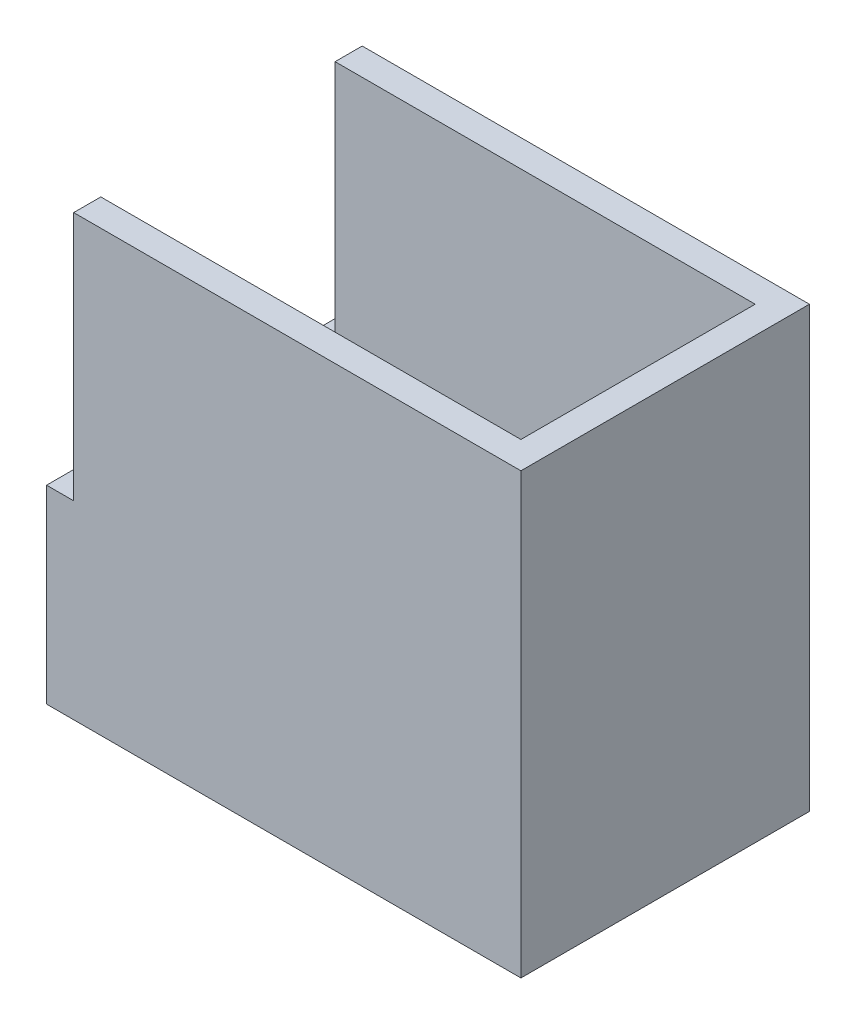
ISO-10303-21;
HEADER;
FILE_DESCRIPTION(('STEP AP214'),'2;1');
FILE_NAME('part.step','',(''),(''),'','','');
FILE_SCHEMA(('AUTOMOTIVE_DESIGN { 1 0 10303 214 1 1 1 1 }'));
ENDSEC;
DATA;
#1=APPLICATION_CONTEXT('core data for automotive mechanical design processes');
#2=APPLICATION_PROTOCOL_DEFINITION('international standard','automotive_design',2000,#1);
#3=PRODUCT_CONTEXT('',#1,'mechanical');
#4=PRODUCT('Part','Part','',(#3));
#5=PRODUCT_RELATED_PRODUCT_CATEGORY('part','',(#4));
#6=PRODUCT_DEFINITION_FORMATION('','',#4);
#7=PRODUCT_DEFINITION_CONTEXT('part definition',#1,'design');
#8=PRODUCT_DEFINITION('design','',#6,#7);
#9=PRODUCT_DEFINITION_SHAPE('','',#8);
#10=(LENGTH_UNIT() NAMED_UNIT(*) SI_UNIT(.MILLI.,.METRE.));
#11=(NAMED_UNIT(*) PLANE_ANGLE_UNIT() SI_UNIT($,.RADIAN.));
#12=(NAMED_UNIT(*) SI_UNIT($,.STERADIAN.) SOLID_ANGLE_UNIT());
#13=UNCERTAINTY_MEASURE_WITH_UNIT(LENGTH_MEASURE(1.E-05),#10,'distance_accuracy_value','');
#14=(GEOMETRIC_REPRESENTATION_CONTEXT(3) GLOBAL_UNCERTAINTY_ASSIGNED_CONTEXT((#13)) GLOBAL_UNIT_ASSIGNED_CONTEXT((#10,
#11,#12)) REPRESENTATION_CONTEXT('',''));
#15=CARTESIAN_POINT('',(0.,0.,0.));
#16=DIRECTION('',(0.,0.,1.));
#17=DIRECTION('',(1.,0.,0.));
#18=AXIS2_PLACEMENT_3D('',#15,#16,#17);
#19=CARTESIAN_POINT('',(-13.12,22.8,-7.98));
#20=DIRECTION('',(0.,0.,-1.));
#21=DIRECTION('',(-1.,0.,0.));
#22=AXIS2_PLACEMENT_3D('',#19,#20,#21);
#23=PLANE('',#22);
#24=DIRECTION('',(0.,-1.,0.));
#25=VECTOR('',#24,1.);
#26=CARTESIAN_POINT('',(-11.62,0.,-7.98));
#27=LINE('',#26,#25);
#28=CARTESIAN_POINT('',(-11.62,22.8,-7.98));
#29=VERTEX_POINT('',#28);
#30=CARTESIAN_POINT('',(-11.62,8.99,-7.98));
#31=VERTEX_POINT('',#30);
#32=EDGE_CURVE('E228',#29,#31,#27,.T.);
#33=ORIENTED_EDGE('',*,*,#32,.F.);
#34=DIRECTION('',(1.,0.,0.));
#35=VECTOR('',#34,1.);
#36=CARTESIAN_POINT('',(-13.12,22.8,-7.98));
#37=LINE('',#36,#35);
#38=CARTESIAN_POINT('',(13.12,22.8,-7.98));
#39=VERTEX_POINT('',#38);
#40=EDGE_CURVE('E332',#29,#39,#37,.T.);
#41=ORIENTED_EDGE('',*,*,#40,.T.);
#42=DIRECTION('',(0.,-1.,0.));
#43=VECTOR('',#42,1.);
#44=CARTESIAN_POINT('',(13.12,22.8,-7.98));
#45=LINE('',#44,#43);
#46=CARTESIAN_POINT('',(13.12,-1.5,-7.98));
#47=VERTEX_POINT('',#46);
#48=EDGE_CURVE('E68',#39,#47,#45,.T.);
#49=ORIENTED_EDGE('',*,*,#48,.T.);
#50=DIRECTION('',(1.,0.,0.));
#51=VECTOR('',#50,1.);
#52=CARTESIAN_POINT('',(0.,-1.5,-7.98));
#53=LINE('',#52,#51);
#54=CARTESIAN_POINT('',(-13.12,-1.5,-7.98));
#55=VERTEX_POINT('',#54);
#56=EDGE_CURVE('E264',#55,#47,#53,.T.);
#57=ORIENTED_EDGE('',*,*,#56,.F.);
#58=DIRECTION('',(0.,-1.,0.));
#59=VECTOR('',#58,1.);
#60=CARTESIAN_POINT('',(-13.12,22.8,-7.98));
#61=LINE('',#60,#59);
#62=CARTESIAN_POINT('',(-13.12,8.99,-7.98));
#63=VERTEX_POINT('',#62);
#64=EDGE_CURVE('E12',#63,#55,#61,.T.);
#65=ORIENTED_EDGE('',*,*,#64,.F.);
#66=DIRECTION('',(-1.,0.,0.));
#67=VECTOR('',#66,1.);
#68=CARTESIAN_POINT('',(10.3236824621575,8.99,-7.98));
#69=LINE('',#68,#67);
#70=EDGE_CURVE('E232',#31,#63,#69,.T.);
#71=ORIENTED_EDGE('',*,*,#70,.F.);
#72=EDGE_LOOP('',(#33,#41,#49,#57,#65,#71));
#73=FACE_BOUND('',#72,.T.);
#74=ADVANCED_FACE('F65',(#73),#23,.T.);
#75=CARTESIAN_POINT('',(-13.12,22.8,-7.98));
#76=DIRECTION('',(1.,0.,0.));
#77=DIRECTION('',(0.,0.,-1.));
#78=AXIS2_PLACEMENT_3D('',#75,#76,#77);
#79=PLANE('',#78);
#80=DIRECTION('',(0.,-1.,0.));
#81=VECTOR('',#80,1.);
#82=CARTESIAN_POINT('',(-13.12,22.8,7.98));
#83=LINE('',#82,#81);
#84=CARTESIAN_POINT('',(-13.12,8.99,7.98));
#85=VERTEX_POINT('',#84);
#86=CARTESIAN_POINT('',(-13.12,-1.5,7.98));
#87=VERTEX_POINT('',#86);
#88=EDGE_CURVE('E74',#85,#87,#83,.T.);
#89=ORIENTED_EDGE('',*,*,#88,.F.);
#90=DIRECTION('',(0.,0.,1.));
#91=VECTOR('',#90,1.);
#92=CARTESIAN_POINT('',(-13.12,8.99,0.));
#93=LINE('',#92,#91);
#94=CARTESIAN_POINT('',(-13.12,8.99,1.60078105935821));
#95=VERTEX_POINT('',#94);
#96=EDGE_CURVE('E216',#95,#85,#93,.T.);
#97=ORIENTED_EDGE('',*,*,#96,.F.);
#98=CARTESIAN_POINT('',(-13.12,9.39,0.));
#99=DIRECTION('',(-1.,0.,0.));
#100=DIRECTION('',(0.,0.,1.));
#101=AXIS2_PLACEMENT_3D('',#98,#99,#100);
#102=CIRCLE('',#101,1.65);
#103=CARTESIAN_POINT('',(-13.12,8.99,-1.60078105935821));
#104=VERTEX_POINT('',#103);
#105=EDGE_CURVE('E207',#104,#95,#102,.T.);
#106=ORIENTED_EDGE('',*,*,#105,.F.);
#107=EDGE_CURVE('E220',#63,#104,#93,.T.);
#108=ORIENTED_EDGE('',*,*,#107,.F.);
#109=ORIENTED_EDGE('',*,*,#64,.T.);
#110=DIRECTION('',(0.,0.,1.));
#111=VECTOR('',#110,1.);
#112=CARTESIAN_POINT('',(-13.12,-1.5,0.));
#113=LINE('',#112,#111);
#114=EDGE_CURVE('E268',#55,#87,#113,.T.);
#115=ORIENTED_EDGE('',*,*,#114,.T.);
#116=EDGE_LOOP('',(#89,#97,#106,#108,#109,#115));
#117=FACE_BOUND('',#116,.T.);
#118=ADVANCED_FACE('F370',(#117),#79,.F.);
#119=CARTESIAN_POINT('',(-13.12,22.8,7.98));
#120=DIRECTION('',(0.,0.,-1.));
#121=DIRECTION('',(-1.,0.,0.));
#122=AXIS2_PLACEMENT_3D('',#119,#120,#121);
#123=PLANE('',#122);
#124=DIRECTION('',(1.,0.,0.));
#125=VECTOR('',#124,1.);
#126=CARTESIAN_POINT('',(-13.12,22.8,7.98));
#127=LINE('',#126,#125);
#128=CARTESIAN_POINT('',(-11.62,22.8,7.98));
#129=VERTEX_POINT('',#128);
#130=CARTESIAN_POINT('',(13.12,22.8,7.98));
#131=VERTEX_POINT('',#130);
#132=EDGE_CURVE('E90',#129,#131,#127,.T.);
#133=ORIENTED_EDGE('',*,*,#132,.F.);
#134=DIRECTION('',(0.,1.,0.));
#135=VECTOR('',#134,1.);
#136=CARTESIAN_POINT('',(-11.62,0.,7.98));
#137=LINE('',#136,#135);
#138=CARTESIAN_POINT('',(-11.62,8.99,7.98));
#139=VERTEX_POINT('',#138);
#140=EDGE_CURVE('E237',#139,#129,#137,.T.);
#141=ORIENTED_EDGE('',*,*,#140,.F.);
#142=DIRECTION('',(-1.,0.,0.));
#143=VECTOR('',#142,1.);
#144=CARTESIAN_POINT('',(10.3236824621575,8.99,7.98));
#145=LINE('',#144,#143);
#146=EDGE_CURVE('E200',#139,#85,#145,.T.);
#147=ORIENTED_EDGE('',*,*,#146,.T.);
#148=ORIENTED_EDGE('',*,*,#88,.T.);
#149=DIRECTION('',(1.,0.,0.));
#150=VECTOR('',#149,1.);
#151=CARTESIAN_POINT('',(0.,-1.5,7.98));
#152=LINE('',#151,#150);
#153=CARTESIAN_POINT('',(13.12,-1.5,7.98));
#154=VERTEX_POINT('',#153);
#155=EDGE_CURVE('E272',#87,#154,#152,.T.);
#156=ORIENTED_EDGE('',*,*,#155,.T.);
#157=DIRECTION('',(0.,-1.,0.));
#158=VECTOR('',#157,1.);
#159=CARTESIAN_POINT('',(13.12,22.8,7.98));
#160=LINE('',#159,#158);
#161=EDGE_CURVE('E352',#131,#154,#160,.T.);
#162=ORIENTED_EDGE('',*,*,#161,.F.);
#163=EDGE_LOOP('',(#133,#141,#147,#148,#156,#162));
#164=FACE_BOUND('',#163,.T.);
#165=ADVANCED_FACE('F387',(#164),#123,.F.);
#166=CARTESIAN_POINT('',(13.12,22.8,-7.98));
#167=DIRECTION('',(1.,0.,0.));
#168=DIRECTION('',(0.,0.,-1.));
#169=AXIS2_PLACEMENT_3D('',#166,#167,#168);
#170=PLANE('',#169);
#171=ORIENTED_EDGE('',*,*,#161,.T.);
#172=DIRECTION('',(0.,0.,1.));
#173=VECTOR('',#172,1.);
#174=CARTESIAN_POINT('',(13.12,-1.5,0.));
#175=LINE('',#174,#173);
#176=EDGE_CURVE('E276',#47,#154,#175,.T.);
#177=ORIENTED_EDGE('',*,*,#176,.F.);
#178=ORIENTED_EDGE('',*,*,#48,.F.);
#179=DIRECTION('',(0.,0.,1.));
#180=VECTOR('',#179,1.);
#181=CARTESIAN_POINT('',(13.12,22.8,-7.98));
#182=LINE('',#181,#180);
#183=EDGE_CURVE('E345',#39,#131,#182,.T.);
#184=ORIENTED_EDGE('',*,*,#183,.T.);
#185=EDGE_LOOP('',(#171,#177,#178,#184));
#186=FACE_BOUND('',#185,.T.);
#187=ADVANCED_FACE('F364',(#186),#170,.T.);
#188=CARTESIAN_POINT('',(0.,22.8,0.));
#189=DIRECTION('',(0.,-1.,0.));
#190=DIRECTION('',(0.,0.,-1.));
#191=AXIS2_PLACEMENT_3D('',#188,#189,#190);
#192=PLANE('',#191);
#193=ORIENTED_EDGE('',*,*,#40,.F.);
#194=DIRECTION('',(0.,0.,-1.));
#195=VECTOR('',#194,1.);
#196=CARTESIAN_POINT('',(-11.62,22.8,0.));
#197=LINE('',#196,#195);
#198=CARTESIAN_POINT('',(-11.62,22.8,-6.48));
#199=VERTEX_POINT('',#198);
#200=EDGE_CURVE('E236',#199,#29,#197,.T.);
#201=ORIENTED_EDGE('',*,*,#200,.F.);
#202=DIRECTION('',(1.,0.,0.));
#203=VECTOR('',#202,1.);
#204=CARTESIAN_POINT('',(-11.62,22.8,-6.48));
#205=LINE('',#204,#203);
#206=CARTESIAN_POINT('',(11.62,22.8,-6.48));
#207=VERTEX_POINT('',#206);
#208=EDGE_CURVE('E301',#199,#207,#205,.T.);
#209=ORIENTED_EDGE('',*,*,#208,.T.);
#210=DIRECTION('',(0.,0.,1.));
#211=VECTOR('',#210,1.);
#212=CARTESIAN_POINT('',(11.62,22.8,-6.48));
#213=LINE('',#212,#211);
#214=CARTESIAN_POINT('',(11.62,22.8,6.48));
#215=VERTEX_POINT('',#214);
#216=EDGE_CURVE('E305',#207,#215,#213,.T.);
#217=ORIENTED_EDGE('',*,*,#216,.T.);
#218=DIRECTION('',(1.,0.,0.));
#219=VECTOR('',#218,1.);
#220=CARTESIAN_POINT('',(-11.62,22.8,6.48));
#221=LINE('',#220,#219);
#222=CARTESIAN_POINT('',(-11.62,22.8,6.48));
#223=VERTEX_POINT('',#222);
#224=EDGE_CURVE('E310',#223,#215,#221,.T.);
#225=ORIENTED_EDGE('',*,*,#224,.F.);
#226=EDGE_CURVE('E233',#129,#223,#197,.T.);
#227=ORIENTED_EDGE('',*,*,#226,.F.);
#228=ORIENTED_EDGE('',*,*,#132,.T.);
#229=ORIENTED_EDGE('',*,*,#183,.F.);
#230=EDGE_LOOP('',(#193,#201,#209,#217,#225,#227,#228,#229));
#231=FACE_BOUND('',#230,.T.);
#232=ADVANCED_FACE('F388',(#231),#192,.F.);
#233=CARTESIAN_POINT('',(-11.62,22.8,-6.48));
#234=DIRECTION('',(0.,0.,-1.));
#235=DIRECTION('',(-1.,0.,0.));
#236=AXIS2_PLACEMENT_3D('',#233,#234,#235);
#237=PLANE('',#236);
#238=DIRECTION('',(1.,0.,0.));
#239=VECTOR('',#238,1.);
#240=CARTESIAN_POINT('',(-11.62,0.,-6.48));
#241=LINE('',#240,#239);
#242=CARTESIAN_POINT('',(-11.62,0.,-6.48));
#243=VERTEX_POINT('',#242);
#244=CARTESIAN_POINT('',(-9.7,0.,-6.48));
#245=VERTEX_POINT('',#244);
#246=EDGE_CURVE('E314',#243,#245,#241,.T.);
#247=ORIENTED_EDGE('',*,*,#246,.T.);
#248=DIRECTION('',(0.,1.,0.));
#249=VECTOR('',#248,1.);
#250=CARTESIAN_POINT('',(-9.7,-1.5,-6.48));
#251=LINE('',#250,#249);
#252=CARTESIAN_POINT('',(-9.7,-1.5,-6.48));
#253=VERTEX_POINT('',#252);
#254=EDGE_CURVE('E280',#253,#245,#251,.T.);
#255=ORIENTED_EDGE('',*,*,#254,.F.);
#256=DIRECTION('',(1.,0.,0.));
#257=VECTOR('',#256,1.);
#258=CARTESIAN_POINT('',(0.,-1.5,-6.48));
#259=LINE('',#258,#257);
#260=CARTESIAN_POINT('',(-6.38,-1.5,-6.48));
#261=VERTEX_POINT('',#260);
#262=EDGE_CURVE('E252',#253,#261,#259,.T.);
#263=ORIENTED_EDGE('',*,*,#262,.T.);
#264=DIRECTION('',(0.,1.,0.));
#265=VECTOR('',#264,1.);
#266=CARTESIAN_POINT('',(-6.38,-1.5,-6.48));
#267=LINE('',#266,#265);
#268=CARTESIAN_POINT('',(-6.38,0.,-6.48));
#269=VERTEX_POINT('',#268);
#270=EDGE_CURVE('E295',#261,#269,#267,.T.);
#271=ORIENTED_EDGE('',*,*,#270,.T.);
#272=CARTESIAN_POINT('',(11.62,0.,-6.48));
#273=VERTEX_POINT('',#272);
#274=EDGE_CURVE('E291',#269,#273,#241,.T.);
#275=ORIENTED_EDGE('',*,*,#274,.T.);
#276=DIRECTION('',(0.,-1.,0.));
#277=VECTOR('',#276,1.);
#278=CARTESIAN_POINT('',(11.62,22.8,-6.48));
#279=LINE('',#278,#277);
#280=EDGE_CURVE('E313',#207,#273,#279,.T.);
#281=ORIENTED_EDGE('',*,*,#280,.F.);
#282=ORIENTED_EDGE('',*,*,#208,.F.);
#283=DIRECTION('',(0.,-1.,0.));
#284=VECTOR('',#283,1.);
#285=CARTESIAN_POINT('',(-11.62,22.8,-6.48));
#286=LINE('',#285,#284);
#287=CARTESIAN_POINT('',(-11.62,8.99,-6.48));
#288=VERTEX_POINT('',#287);
#289=EDGE_CURVE('E328',#199,#288,#286,.T.);
#290=ORIENTED_EDGE('',*,*,#289,.T.);
#291=EDGE_CURVE('E333',#288,#243,#286,.T.);
#292=ORIENTED_EDGE('',*,*,#291,.T.);
#293=EDGE_LOOP('',(#247,#255,#263,#271,#275,#281,#282,#290,#292));
#294=FACE_BOUND('',#293,.T.);
#295=ADVANCED_FACE('F390',(#294),#237,.F.);
#296=CARTESIAN_POINT('',(-11.62,22.8,-6.48));
#297=DIRECTION('',(1.,0.,0.));
#298=DIRECTION('',(0.,0.,-1.));
#299=AXIS2_PLACEMENT_3D('',#296,#297,#298);
#300=PLANE('',#299);
#301=DIRECTION('',(0.,0.,1.));
#302=VECTOR('',#301,1.);
#303=CARTESIAN_POINT('',(-11.62,8.99,0.));
#304=LINE('',#303,#302);
#305=CARTESIAN_POINT('',(-11.62,8.99,1.60078105935821));
#306=VERTEX_POINT('',#305);
#307=CARTESIAN_POINT('',(-11.62,8.99,6.48));
#308=VERTEX_POINT('',#307);
#309=EDGE_CURVE('E189',#306,#308,#304,.T.);
#310=ORIENTED_EDGE('',*,*,#309,.T.);
#311=DIRECTION('',(0.,-1.,0.));
#312=VECTOR('',#311,1.);
#313=CARTESIAN_POINT('',(-11.62,22.8,6.48));
#314=LINE('',#313,#312);
#315=CARTESIAN_POINT('',(-11.62,0.,6.48));
#316=VERTEX_POINT('',#315);
#317=EDGE_CURVE('E337',#308,#316,#314,.T.);
#318=ORIENTED_EDGE('',*,*,#317,.T.);
#319=DIRECTION('',(0.,0.,1.));
#320=VECTOR('',#319,1.);
#321=CARTESIAN_POINT('',(-11.62,0.,-6.48));
#322=LINE('',#321,#320);
#323=EDGE_CURVE('E306',#243,#316,#322,.T.);
#324=ORIENTED_EDGE('',*,*,#323,.F.);
#325=ORIENTED_EDGE('',*,*,#291,.F.);
#326=DIRECTION('',(0.,0.,1.));
#327=VECTOR('',#326,1.);
#328=CARTESIAN_POINT('',(-11.62,8.99,0.));
#329=LINE('',#328,#327);
#330=CARTESIAN_POINT('',(-11.62,8.99,-1.60078105935821));
#331=VERTEX_POINT('',#330);
#332=EDGE_CURVE('E214',#288,#331,#329,.T.);
#333=ORIENTED_EDGE('',*,*,#332,.T.);
#334=CARTESIAN_POINT('',(-11.62,9.39,0.));
#335=DIRECTION('',(1.,0.,0.));
#336=DIRECTION('',(0.,0.,-1.));
#337=AXIS2_PLACEMENT_3D('',#334,#335,#336);
#338=CIRCLE('',#337,1.65);
#339=EDGE_CURVE('E204',#331,#306,#338,.F.);
#340=ORIENTED_EDGE('',*,*,#339,.T.);
#341=EDGE_LOOP('',(#310,#318,#324,#325,#333,#340));
#342=FACE_BOUND('',#341,.T.);
#343=ADVANCED_FACE('F212',(#342),#300,.T.);
#344=CARTESIAN_POINT('',(-11.62,22.8,6.48));
#345=DIRECTION('',(0.,0.,-1.));
#346=DIRECTION('',(-1.,0.,0.));
#347=AXIS2_PLACEMENT_3D('',#344,#345,#346);
#348=PLANE('',#347);
#349=DIRECTION('',(1.,0.,0.));
#350=VECTOR('',#349,1.);
#351=CARTESIAN_POINT('',(-11.62,0.,6.48));
#352=LINE('',#351,#350);
#353=CARTESIAN_POINT('',(-9.7,0.,6.48));
#354=VERTEX_POINT('',#353);
#355=EDGE_CURVE('E322',#316,#354,#352,.T.);
#356=ORIENTED_EDGE('',*,*,#355,.F.);
#357=ORIENTED_EDGE('',*,*,#317,.F.);
#358=EDGE_CURVE('E334',#223,#308,#314,.T.);
#359=ORIENTED_EDGE('',*,*,#358,.F.);
#360=ORIENTED_EDGE('',*,*,#224,.T.);
#361=DIRECTION('',(0.,-1.,0.));
#362=VECTOR('',#361,1.);
#363=CARTESIAN_POINT('',(11.62,22.8,6.48));
#364=LINE('',#363,#362);
#365=CARTESIAN_POINT('',(11.62,0.,6.48));
#366=VERTEX_POINT('',#365);
#367=EDGE_CURVE('E82',#215,#366,#364,.T.);
#368=ORIENTED_EDGE('',*,*,#367,.T.);
#369=CARTESIAN_POINT('',(-6.38,0.,6.48));
#370=VERTEX_POINT('',#369);
#371=EDGE_CURVE('E321',#370,#366,#352,.T.);
#372=ORIENTED_EDGE('',*,*,#371,.F.);
#373=DIRECTION('',(0.,1.,0.));
#374=VECTOR('',#373,1.);
#375=CARTESIAN_POINT('',(-6.38,-1.5,6.48));
#376=LINE('',#375,#374);
#377=CARTESIAN_POINT('',(-6.38,-1.5,6.48));
#378=VERTEX_POINT('',#377);
#379=EDGE_CURVE('E292',#378,#370,#376,.T.);
#380=ORIENTED_EDGE('',*,*,#379,.F.);
#381=DIRECTION('',(1.,0.,0.));
#382=VECTOR('',#381,1.);
#383=CARTESIAN_POINT('',(0.,-1.5,6.48));
#384=LINE('',#383,#382);
#385=CARTESIAN_POINT('',(-9.7,-1.5,6.48));
#386=VERTEX_POINT('',#385);
#387=EDGE_CURVE('E261',#386,#378,#384,.T.);
#388=ORIENTED_EDGE('',*,*,#387,.F.);
#389=DIRECTION('',(0.,1.,0.));
#390=VECTOR('',#389,1.);
#391=CARTESIAN_POINT('',(-9.7,-1.5,6.48));
#392=LINE('',#391,#390);
#393=EDGE_CURVE('E287',#386,#354,#392,.T.);
#394=ORIENTED_EDGE('',*,*,#393,.T.);
#395=EDGE_LOOP('',(#356,#357,#359,#360,#368,#372,#380,#388,#394));
#396=FACE_BOUND('',#395,.T.);
#397=ADVANCED_FACE('F426',(#396),#348,.T.);
#398=CARTESIAN_POINT('',(11.62,22.8,-6.48));
#399=DIRECTION('',(1.,0.,0.));
#400=DIRECTION('',(0.,0.,-1.));
#401=AXIS2_PLACEMENT_3D('',#398,#399,#400);
#402=PLANE('',#401);
#403=DIRECTION('',(0.,0.,1.));
#404=VECTOR('',#403,1.);
#405=CARTESIAN_POINT('',(11.62,0.,-6.48));
#406=LINE('',#405,#404);
#407=EDGE_CURVE('E318',#273,#366,#406,.T.);
#408=ORIENTED_EDGE('',*,*,#407,.T.);
#409=ORIENTED_EDGE('',*,*,#367,.F.);
#410=ORIENTED_EDGE('',*,*,#216,.F.);
#411=ORIENTED_EDGE('',*,*,#280,.T.);
#412=EDGE_LOOP('',(#408,#409,#410,#411));
#413=FACE_BOUND('',#412,.T.);
#414=ADVANCED_FACE('F420',(#413),#402,.F.);
#415=CARTESIAN_POINT('',(0.,0.,0.));
#416=DIRECTION('',(0.,1.,0.));
#417=DIRECTION('',(0.,0.,1.));
#418=AXIS2_PLACEMENT_3D('',#415,#416,#417);
#419=PLANE('',#418);
#420=ORIENTED_EDGE('',*,*,#246,.F.);
#421=ORIENTED_EDGE('',*,*,#323,.T.);
#422=ORIENTED_EDGE('',*,*,#355,.T.);
#423=DIRECTION('',(0.,0.,1.));
#424=VECTOR('',#423,1.);
#425=CARTESIAN_POINT('',(-9.7,0.,0.));
#426=LINE('',#425,#424);
#427=EDGE_CURVE('E247',#245,#354,#426,.T.);
#428=ORIENTED_EDGE('',*,*,#427,.F.);
#429=EDGE_LOOP('',(#420,#421,#422,#428));
#430=FACE_BOUND('',#429,.T.);
#431=ADVANCED_FACE('F425',(#430),#419,.T.);
#432=ORIENTED_EDGE('',*,*,#274,.F.);
#433=DIRECTION('',(0.,0.,1.));
#434=VECTOR('',#433,1.);
#435=CARTESIAN_POINT('',(-6.38,0.,0.));
#436=LINE('',#435,#434);
#437=EDGE_CURVE('E253',#269,#370,#436,.T.);
#438=ORIENTED_EDGE('',*,*,#437,.T.);
#439=ORIENTED_EDGE('',*,*,#371,.T.);
#440=ORIENTED_EDGE('',*,*,#407,.F.);
#441=EDGE_LOOP('',(#432,#438,#439,#440));
#442=FACE_BOUND('',#441,.T.);
#443=ADVANCED_FACE('F438',(#442),#419,.T.);
#444=CARTESIAN_POINT('',(-9.7,-1.5,0.));
#445=DIRECTION('',(-1.,0.,0.));
#446=DIRECTION('',(0.,0.,1.));
#447=AXIS2_PLACEMENT_3D('',#444,#445,#446);
#448=PLANE('',#447);
#449=ORIENTED_EDGE('',*,*,#427,.T.);
#450=ORIENTED_EDGE('',*,*,#393,.F.);
#451=DIRECTION('',(0.,0.,1.));
#452=VECTOR('',#451,1.);
#453=CARTESIAN_POINT('',(-9.7,-1.5,0.));
#454=LINE('',#453,#452);
#455=EDGE_CURVE('E248',#253,#386,#454,.T.);
#456=ORIENTED_EDGE('',*,*,#455,.F.);
#457=ORIENTED_EDGE('',*,*,#254,.T.);
#458=EDGE_LOOP('',(#449,#450,#456,#457));
#459=FACE_BOUND('',#458,.T.);
#460=ADVANCED_FACE('F450',(#459),#448,.F.);
#461=CARTESIAN_POINT('',(-6.38,-1.5,0.));
#462=DIRECTION('',(-1.,0.,0.));
#463=DIRECTION('',(0.,0.,1.));
#464=AXIS2_PLACEMENT_3D('',#461,#462,#463);
#465=PLANE('',#464);
#466=ORIENTED_EDGE('',*,*,#437,.F.);
#467=ORIENTED_EDGE('',*,*,#270,.F.);
#468=DIRECTION('',(0.,0.,1.));
#469=VECTOR('',#468,1.);
#470=CARTESIAN_POINT('',(-6.38,-1.5,0.));
#471=LINE('',#470,#469);
#472=EDGE_CURVE('E257',#261,#378,#471,.T.);
#473=ORIENTED_EDGE('',*,*,#472,.T.);
#474=ORIENTED_EDGE('',*,*,#379,.T.);
#475=EDGE_LOOP('',(#466,#467,#473,#474));
#476=FACE_BOUND('',#475,.T.);
#477=ADVANCED_FACE('F460',(#476),#465,.T.);
#478=CARTESIAN_POINT('',(0.,-1.5,0.));
#479=DIRECTION('',(0.,1.,0.));
#480=DIRECTION('',(0.,0.,1.));
#481=AXIS2_PLACEMENT_3D('',#478,#479,#480);
#482=PLANE('',#481);
#483=ORIENTED_EDGE('',*,*,#455,.T.);
#484=ORIENTED_EDGE('',*,*,#387,.T.);
#485=ORIENTED_EDGE('',*,*,#472,.F.);
#486=ORIENTED_EDGE('',*,*,#262,.F.);
#487=EDGE_LOOP('',(#483,#484,#485,#486));
#488=FACE_BOUND('',#487,.T.);
#489=ORIENTED_EDGE('',*,*,#56,.T.);
#490=ORIENTED_EDGE('',*,*,#176,.T.);
#491=ORIENTED_EDGE('',*,*,#155,.F.);
#492=ORIENTED_EDGE('',*,*,#114,.F.);
#493=EDGE_LOOP('',(#489,#490,#491,#492));
#494=FACE_BOUND('',#493,.T.);
#495=ADVANCED_FACE('F367',(#488,#494),#482,.F.);
#496=CARTESIAN_POINT('',(-11.62,22.8,-6.48));
#497=DIRECTION('',(1.,0.,0.));
#498=DIRECTION('',(0.,0.,-1.));
#499=AXIS2_PLACEMENT_3D('',#496,#497,#498);
#500=PLANE('',#499);
#501=ORIENTED_EDGE('',*,*,#200,.T.);
#502=ORIENTED_EDGE('',*,*,#32,.T.);
#503=EDGE_CURVE('E223',#31,#288,#329,.T.);
#504=ORIENTED_EDGE('',*,*,#503,.T.);
#505=ORIENTED_EDGE('',*,*,#289,.F.);
#506=EDGE_LOOP('',(#501,#502,#504,#505));
#507=FACE_BOUND('',#506,.T.);
#508=ADVANCED_FACE('F377',(#507),#500,.F.);
#509=ORIENTED_EDGE('',*,*,#358,.T.);
#510=EDGE_CURVE('E195',#308,#139,#304,.T.);
#511=ORIENTED_EDGE('',*,*,#510,.T.);
#512=ORIENTED_EDGE('',*,*,#140,.T.);
#513=ORIENTED_EDGE('',*,*,#226,.T.);
#514=EDGE_LOOP('',(#509,#511,#512,#513));
#515=FACE_BOUND('',#514,.T.);
#516=ADVANCED_FACE('F383',(#515),#500,.F.);
#517=CARTESIAN_POINT('',(10.3236824621575,9.39,0.));
#518=DIRECTION('',(-1.,0.,0.));
#519=DIRECTION('',(0.,0.,1.));
#520=AXIS2_PLACEMENT_3D('',#517,#518,#519);
#521=CYLINDRICAL_SURFACE('',#520,1.65);
#522=DIRECTION('',(-1.,0.,0.));
#523=VECTOR('',#522,1.);
#524=CARTESIAN_POINT('',(10.3236824621575,8.99,-1.60078105935822));
#525=LINE('',#524,#523);
#526=EDGE_CURVE('E227',#331,#104,#525,.T.);
#527=ORIENTED_EDGE('',*,*,#526,.T.);
#528=ORIENTED_EDGE('',*,*,#105,.T.);
#529=DIRECTION('',(-1.,0.,0.));
#530=VECTOR('',#529,1.);
#531=CARTESIAN_POINT('',(10.3236824621575,8.99,1.60078105935821));
#532=LINE('',#531,#530);
#533=EDGE_CURVE('E192',#306,#95,#532,.T.);
#534=ORIENTED_EDGE('',*,*,#533,.F.);
#535=ORIENTED_EDGE('',*,*,#339,.F.);
#536=EDGE_LOOP('',(#527,#528,#534,#535));
#537=FACE_BOUND('',#536,.T.);
#538=ADVANCED_FACE('F203',(#537),#521,.F.);
#539=CARTESIAN_POINT('',(10.3236824621575,8.99,0.));
#540=DIRECTION('',(0.,-1.,0.));
#541=DIRECTION('',(0.,0.,-1.));
#542=AXIS2_PLACEMENT_3D('',#539,#540,#541);
#543=PLANE('',#542);
#544=ORIENTED_EDGE('',*,*,#533,.T.);
#545=ORIENTED_EDGE('',*,*,#96,.T.);
#546=ORIENTED_EDGE('',*,*,#146,.F.);
#547=ORIENTED_EDGE('',*,*,#510,.F.);
#548=ORIENTED_EDGE('',*,*,#309,.F.);
#549=EDGE_LOOP('',(#544,#545,#546,#547,#548));
#550=FACE_BOUND('',#549,.T.);
#551=ADVANCED_FACE('F191',(#550),#543,.F.);
#552=ORIENTED_EDGE('',*,*,#70,.T.);
#553=ORIENTED_EDGE('',*,*,#107,.T.);
#554=ORIENTED_EDGE('',*,*,#526,.F.);
#555=ORIENTED_EDGE('',*,*,#332,.F.);
#556=ORIENTED_EDGE('',*,*,#503,.F.);
#557=EDGE_LOOP('',(#552,#553,#554,#555,#556));
#558=FACE_BOUND('',#557,.T.);
#559=ADVANCED_FACE('F375',(#558),#543,.F.);
#560=CLOSED_SHELL('',(#74,#118,#165,#187,#232,#295,#343,#397,#414,#431,#443,#460,#477,#495,#508,
#516,#538,#551,#559));
#561=MANIFOLD_SOLID_BREP('B2',#560);
#562=ADVANCED_BREP_SHAPE_REPRESENTATION('',(#18,#561),#14);
#563=SHAPE_DEFINITION_REPRESENTATION(#9,#562);
ENDSEC;
END-ISO-10303-21;
